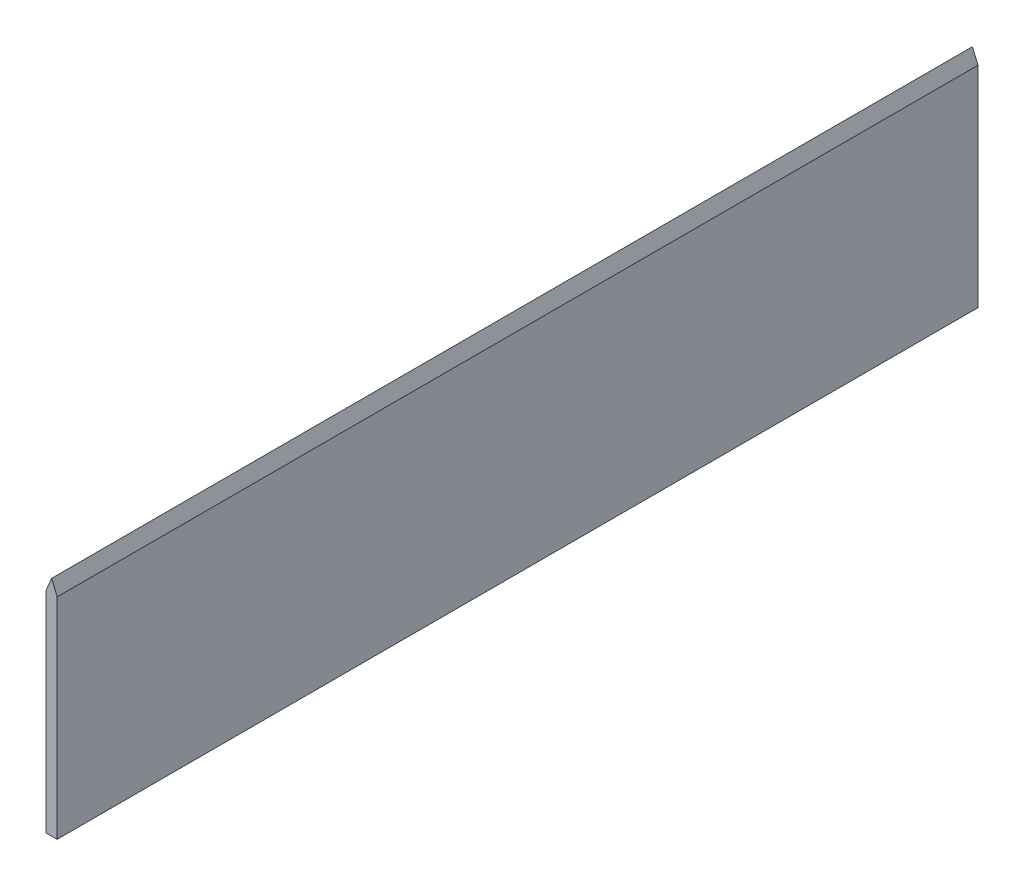
ISO-10303-21;
HEADER;
FILE_DESCRIPTION(('STEP AP214'),'2;1');
FILE_NAME('part.step','',(''),(''),'','','');
FILE_SCHEMA(('AUTOMOTIVE_DESIGN { 1 0 10303 214 1 1 1 1 }'));
ENDSEC;
DATA;
#1=APPLICATION_CONTEXT('core data for automotive mechanical design processes');
#2=APPLICATION_PROTOCOL_DEFINITION('international standard','automotive_design',2000,#1);
#3=PRODUCT_CONTEXT('',#1,'mechanical');
#4=PRODUCT('Part','Part','',(#3));
#5=PRODUCT_RELATED_PRODUCT_CATEGORY('part','',(#4));
#6=PRODUCT_DEFINITION_FORMATION('','',#4);
#7=PRODUCT_DEFINITION_CONTEXT('part definition',#1,'design');
#8=PRODUCT_DEFINITION('design','',#6,#7);
#9=PRODUCT_DEFINITION_SHAPE('','',#8);
#10=(LENGTH_UNIT() NAMED_UNIT(*) SI_UNIT(.MILLI.,.METRE.));
#11=(NAMED_UNIT(*) PLANE_ANGLE_UNIT() SI_UNIT($,.RADIAN.));
#12=(NAMED_UNIT(*) SI_UNIT($,.STERADIAN.) SOLID_ANGLE_UNIT());
#13=UNCERTAINTY_MEASURE_WITH_UNIT(LENGTH_MEASURE(1.E-05),#10,'distance_accuracy_value','');
#14=(GEOMETRIC_REPRESENTATION_CONTEXT(3) GLOBAL_UNCERTAINTY_ASSIGNED_CONTEXT((#13)) GLOBAL_UNIT_ASSIGNED_CONTEXT((#10,
#11,#12)) REPRESENTATION_CONTEXT('',''));
#15=CARTESIAN_POINT('',(0.,0.,0.));
#16=DIRECTION('',(0.,0.,1.));
#17=DIRECTION('',(1.,0.,0.));
#18=AXIS2_PLACEMENT_3D('',#15,#16,#17);
#19=CARTESIAN_POINT('',(-2.,2.3790904062879,165.));
#20=DIRECTION('',(1.,0.,0.));
#21=DIRECTION('',(0.,1.,0.));
#22=AXIS2_PLACEMENT_3D('',#19,#20,#21);
#23=PLANE('',#22);
#24=DIRECTION('',(0.,-1.,0.));
#25=VECTOR('',#24,1.);
#26=CARTESIAN_POINT('',(-2.,2.3790904062879,165.));
#27=LINE('',#26,#25);
#28=CARTESIAN_POINT('',(-2.,0.,165.));
#29=VERTEX_POINT('',#28);
#30=CARTESIAN_POINT('',(-2.,-37.6209095937121,165.));
#31=VERTEX_POINT('',#30);
#32=EDGE_CURVE('E96',#29,#31,#27,.T.);
#33=ORIENTED_EDGE('',*,*,#32,.F.);
#34=DIRECTION('',(0.,0.,1.));
#35=VECTOR('',#34,1.);
#36=CARTESIAN_POINT('',(-2.,0.,0.));
#37=LINE('',#36,#35);
#38=CARTESIAN_POINT('',(-2.,0.,0.));
#39=VERTEX_POINT('',#38);
#40=EDGE_CURVE('E116',#39,#29,#37,.T.);
#41=ORIENTED_EDGE('',*,*,#40,.F.);
#42=DIRECTION('',(0.,-1.,0.));
#43=VECTOR('',#42,1.);
#44=CARTESIAN_POINT('',(-2.,2.3790904062879,0.));
#45=LINE('',#44,#43);
#46=CARTESIAN_POINT('',(-2.,-37.6209095937121,0.));
#47=VERTEX_POINT('',#46);
#48=EDGE_CURVE('E85',#39,#47,#45,.T.);
#49=ORIENTED_EDGE('',*,*,#48,.T.);
#50=DIRECTION('',(0.,0.,-1.));
#51=VECTOR('',#50,1.);
#52=CARTESIAN_POINT('',(-2.,-37.6209095937121,165.));
#53=LINE('',#52,#51);
#54=EDGE_CURVE('E11',#31,#47,#53,.T.);
#55=ORIENTED_EDGE('',*,*,#54,.F.);
#56=EDGE_LOOP('',(#33,#41,#49,#55));
#57=FACE_BOUND('',#56,.T.);
#58=ADVANCED_FACE('F39',(#57),#23,.F.);
#59=CARTESIAN_POINT('',(-2.,-37.6209095937121,165.));
#60=DIRECTION('',(0.,1.,0.));
#61=DIRECTION('',(0.,0.,1.));
#62=AXIS2_PLACEMENT_3D('',#59,#60,#61);
#63=PLANE('',#62);
#64=DIRECTION('',(1.,0.,0.));
#65=VECTOR('',#64,1.);
#66=CARTESIAN_POINT('',(-2.,-37.6209095937121,0.));
#67=LINE('',#66,#65);
#68=CARTESIAN_POINT('',(0.,-37.6209095937121,0.));
#69=VERTEX_POINT('',#68);
#70=EDGE_CURVE('E75',#47,#69,#67,.T.);
#71=ORIENTED_EDGE('',*,*,#70,.T.);
#72=DIRECTION('',(0.,0.,-1.));
#73=VECTOR('',#72,1.);
#74=CARTESIAN_POINT('',(0.,-37.6209095937121,165.));
#75=LINE('',#74,#73);
#76=CARTESIAN_POINT('',(0.,-37.6209095937121,165.));
#77=VERTEX_POINT('',#76);
#78=EDGE_CURVE('E47',#77,#69,#75,.T.);
#79=ORIENTED_EDGE('',*,*,#78,.F.);
#80=DIRECTION('',(1.,0.,0.));
#81=VECTOR('',#80,1.);
#82=CARTESIAN_POINT('',(-2.,-37.6209095937121,165.));
#83=LINE('',#82,#81);
#84=EDGE_CURVE('E63',#31,#77,#83,.T.);
#85=ORIENTED_EDGE('',*,*,#84,.F.);
#86=ORIENTED_EDGE('',*,*,#54,.T.);
#87=EDGE_LOOP('',(#71,#79,#85,#86));
#88=FACE_BOUND('',#87,.T.);
#89=ADVANCED_FACE('F77',(#88),#63,.F.);
#90=CARTESIAN_POINT('',(0.,2.3790904062879,165.));
#91=DIRECTION('',(-1.,0.,0.));
#92=DIRECTION('',(0.,-1.,0.));
#93=AXIS2_PLACEMENT_3D('',#90,#91,#92);
#94=PLANE('',#93);
#95=DIRECTION('',(0.,1.,0.));
#96=VECTOR('',#95,1.);
#97=CARTESIAN_POINT('',(0.,2.3790904062879,0.));
#98=LINE('',#97,#96);
#99=CARTESIAN_POINT('',(0.,0.,0.));
#100=VERTEX_POINT('',#99);
#101=EDGE_CURVE('E84',#69,#100,#98,.T.);
#102=ORIENTED_EDGE('',*,*,#101,.T.);
#103=DIRECTION('',(0.,0.,1.));
#104=VECTOR('',#103,1.);
#105=CARTESIAN_POINT('',(0.,0.,0.));
#106=LINE('',#105,#104);
#107=CARTESIAN_POINT('',(0.,0.,165.));
#108=VERTEX_POINT('',#107);
#109=EDGE_CURVE('E54',#100,#108,#106,.T.);
#110=ORIENTED_EDGE('',*,*,#109,.T.);
#111=DIRECTION('',(0.,1.,0.));
#112=VECTOR('',#111,1.);
#113=CARTESIAN_POINT('',(0.,2.3790904062879,165.));
#114=LINE('',#113,#112);
#115=EDGE_CURVE('E90',#77,#108,#114,.T.);
#116=ORIENTED_EDGE('',*,*,#115,.F.);
#117=ORIENTED_EDGE('',*,*,#78,.T.);
#118=EDGE_LOOP('',(#102,#110,#116,#117));
#119=FACE_BOUND('',#118,.T.);
#120=ADVANCED_FACE('F89',(#119),#94,.F.);
#121=CARTESIAN_POINT('',(0.,0.,165.));
#122=DIRECTION('',(0.,0.,1.));
#123=DIRECTION('',(1.,0.,0.));
#124=AXIS2_PLACEMENT_3D('',#121,#122,#123);
#125=PLANE('',#124);
#126=DIRECTION('',(0.387490059009484,0.921873881921397,0.));
#127=VECTOR('',#126,1.);
#128=CARTESIAN_POINT('',(-2.,0.,165.));
#129=LINE('',#128,#127);
#130=CARTESIAN_POINT('',(-1.,2.3790904062879,165.));
#131=VERTEX_POINT('',#130);
#132=EDGE_CURVE('E123',#29,#131,#129,.T.);
#133=ORIENTED_EDGE('',*,*,#132,.F.);
#134=ORIENTED_EDGE('',*,*,#32,.T.);
#135=ORIENTED_EDGE('',*,*,#84,.T.);
#136=ORIENTED_EDGE('',*,*,#115,.T.);
#137=DIRECTION('',(0.387490059009485,-0.921873881921397,0.));
#138=VECTOR('',#137,1.);
#139=CARTESIAN_POINT('',(0.,0.,165.));
#140=LINE('',#139,#138);
#141=EDGE_CURVE('E113',#131,#108,#140,.T.);
#142=ORIENTED_EDGE('',*,*,#141,.F.);
#143=EDGE_LOOP('',(#133,#134,#135,#136,#142));
#144=FACE_BOUND('',#143,.T.);
#145=ADVANCED_FACE('F141',(#144),#125,.T.);
#146=CARTESIAN_POINT('',(0.,0.,0.));
#147=DIRECTION('',(0.,0.,1.));
#148=DIRECTION('',(1.,0.,0.));
#149=AXIS2_PLACEMENT_3D('',#146,#147,#148);
#150=PLANE('',#149);
#151=ORIENTED_EDGE('',*,*,#48,.F.);
#152=DIRECTION('',(0.387490059009484,0.921873881921397,0.));
#153=VECTOR('',#152,1.);
#154=CARTESIAN_POINT('',(-2.,0.,0.));
#155=LINE('',#154,#153);
#156=CARTESIAN_POINT('',(-1.,2.3790904062879,0.));
#157=VERTEX_POINT('',#156);
#158=EDGE_CURVE('E122',#39,#157,#155,.T.);
#159=ORIENTED_EDGE('',*,*,#158,.T.);
#160=DIRECTION('',(0.387490059009485,-0.921873881921397,0.));
#161=VECTOR('',#160,1.);
#162=CARTESIAN_POINT('',(0.,0.,0.));
#163=LINE('',#162,#161);
#164=EDGE_CURVE('E94',#157,#100,#163,.T.);
#165=ORIENTED_EDGE('',*,*,#164,.T.);
#166=ORIENTED_EDGE('',*,*,#101,.F.);
#167=ORIENTED_EDGE('',*,*,#70,.F.);
#168=EDGE_LOOP('',(#151,#159,#165,#166,#167));
#169=FACE_BOUND('',#168,.T.);
#170=ADVANCED_FACE('F92',(#169),#150,.F.);
#171=CARTESIAN_POINT('',(0.,0.,0.));
#172=DIRECTION('',(-0.921873881921397,-0.387490059009485,0.));
#173=DIRECTION('',(0.387490059009485,-0.921873881921397,0.));
#174=AXIS2_PLACEMENT_3D('',#171,#172,#173);
#175=PLANE('',#174);
#176=ORIENTED_EDGE('',*,*,#141,.T.);
#177=ORIENTED_EDGE('',*,*,#109,.F.);
#178=ORIENTED_EDGE('',*,*,#164,.F.);
#179=DIRECTION('',(0.,0.,1.));
#180=VECTOR('',#179,1.);
#181=CARTESIAN_POINT('',(-1.,2.3790904062879,0.));
#182=LINE('',#181,#180);
#183=EDGE_CURVE('E107',#157,#131,#182,.T.);
#184=ORIENTED_EDGE('',*,*,#183,.T.);
#185=EDGE_LOOP('',(#176,#177,#178,#184));
#186=FACE_BOUND('',#185,.T.);
#187=ADVANCED_FACE('F136',(#186),#175,.F.);
#188=CARTESIAN_POINT('',(-2.,0.,0.));
#189=DIRECTION('',(0.921873881921397,-0.387490059009484,0.));
#190=DIRECTION('',(0.387490059009484,0.921873881921397,0.));
#191=AXIS2_PLACEMENT_3D('',#188,#189,#190);
#192=PLANE('',#191);
#193=ORIENTED_EDGE('',*,*,#132,.T.);
#194=ORIENTED_EDGE('',*,*,#183,.F.);
#195=ORIENTED_EDGE('',*,*,#158,.F.);
#196=ORIENTED_EDGE('',*,*,#40,.T.);
#197=EDGE_LOOP('',(#193,#194,#195,#196));
#198=FACE_BOUND('',#197,.T.);
#199=ADVANCED_FACE('F145',(#198),#192,.F.);
#200=CLOSED_SHELL('',(#58,#89,#120,#145,#170,#187,#199));
#201=MANIFOLD_SOLID_BREP('B2',#200);
#202=ADVANCED_BREP_SHAPE_REPRESENTATION('',(#18,#201),#14);
#203=SHAPE_DEFINITION_REPRESENTATION(#9,#202);
ENDSEC;
END-ISO-10303-21;
